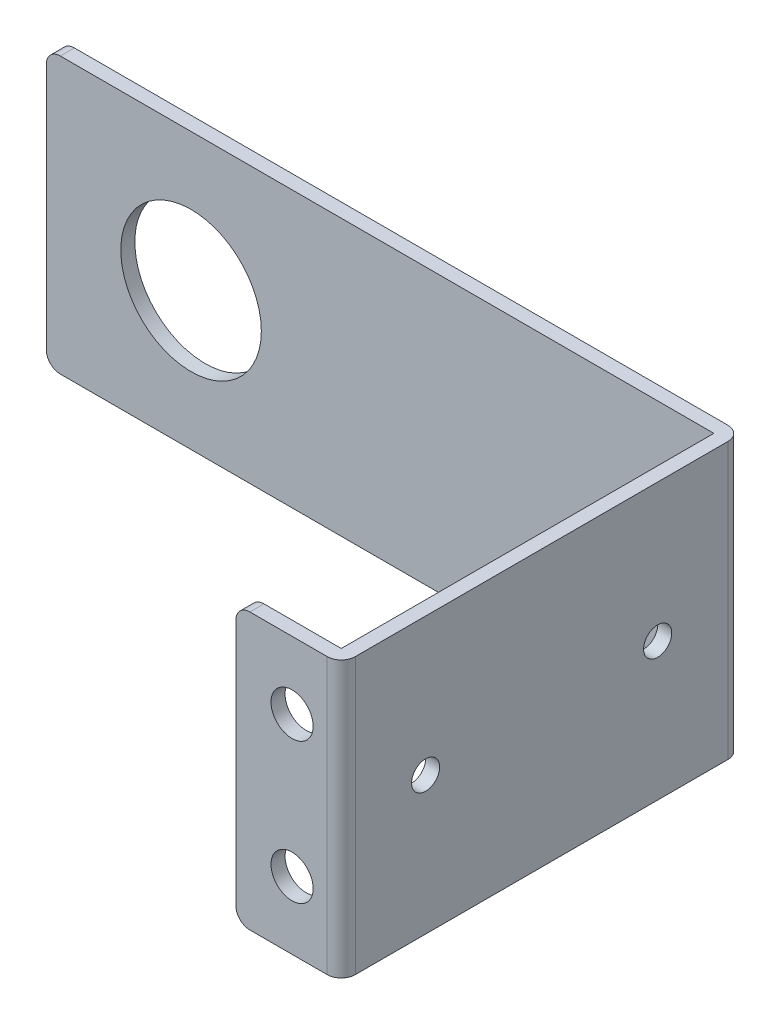
ISO-10303-21;
HEADER;
FILE_DESCRIPTION(('STEP AP214'),'2;1');
FILE_NAME('part.step','',(''),(''),'','','');
FILE_SCHEMA(('AUTOMOTIVE_DESIGN { 1 0 10303 214 1 1 1 1 }'));
ENDSEC;
DATA;
#1=APPLICATION_CONTEXT('core data for automotive mechanical design processes');
#2=APPLICATION_PROTOCOL_DEFINITION('international standard','automotive_design',2000,#1);
#3=PRODUCT_CONTEXT('',#1,'mechanical');
#4=PRODUCT('Part','Part','',(#3));
#5=PRODUCT_RELATED_PRODUCT_CATEGORY('part','',(#4));
#6=PRODUCT_DEFINITION_FORMATION('','',#4);
#7=PRODUCT_DEFINITION_CONTEXT('part definition',#1,'design');
#8=PRODUCT_DEFINITION('design','',#6,#7);
#9=PRODUCT_DEFINITION_SHAPE('','',#8);
#10=(LENGTH_UNIT() NAMED_UNIT(*) SI_UNIT(.MILLI.,.METRE.));
#11=(NAMED_UNIT(*) PLANE_ANGLE_UNIT() SI_UNIT($,.RADIAN.));
#12=(NAMED_UNIT(*) SI_UNIT($,.STERADIAN.) SOLID_ANGLE_UNIT());
#13=UNCERTAINTY_MEASURE_WITH_UNIT(LENGTH_MEASURE(1.E-05),#10,'distance_accuracy_value','');
#14=(GEOMETRIC_REPRESENTATION_CONTEXT(3) GLOBAL_UNCERTAINTY_ASSIGNED_CONTEXT((#13)) GLOBAL_UNIT_ASSIGNED_CONTEXT((#10,
#11,#12)) REPRESENTATION_CONTEXT('',''));
#15=CARTESIAN_POINT('',(0.,0.,0.));
#16=DIRECTION('',(0.,0.,1.));
#17=DIRECTION('',(1.,0.,0.));
#18=AXIS2_PLACEMENT_3D('',#15,#16,#17);
#19=CARTESIAN_POINT('',(23.75,9.8,28.512));
#20=DIRECTION('',(1.,0.,0.));
#21=DIRECTION('',(0.,0.,-1.));
#22=AXIS2_PLACEMENT_3D('',#19,#20,#21);
#23=PLANE('',#22);
#24=CARTESIAN_POINT('',(23.75,0.,22.512));
#25=DIRECTION('',(-1.,0.,0.));
#26=DIRECTION('',(0.,0.,1.));
#27=AXIS2_PLACEMENT_3D('',#24,#25,#26);
#28=CIRCLE('',#27,1.);
#29=CARTESIAN_POINT('',(23.75,0.,23.512));
#30=VERTEX_POINT('',#29);
#31=EDGE_CURVE('E270',#30,#30,#28,.T.);
#32=ORIENTED_EDGE('',*,*,#31,.F.);
#33=EDGE_LOOP('',(#32));
#34=FACE_BOUND('',#33,.T.);
#35=CARTESIAN_POINT('',(23.75,0.,6.));
#36=DIRECTION('',(-1.,0.,0.));
#37=DIRECTION('',(0.,0.,1.));
#38=AXIS2_PLACEMENT_3D('',#35,#36,#37);
#39=CIRCLE('',#38,1.);
#40=CARTESIAN_POINT('',(23.75,0.,7.));
#41=VERTEX_POINT('',#40);
#42=EDGE_CURVE('E269',#41,#41,#39,.T.);
#43=ORIENTED_EDGE('',*,*,#42,.F.);
#44=EDGE_LOOP('',(#43));
#45=FACE_BOUND('',#44,.T.);
#46=DIRECTION('',(0.,-1.,0.));
#47=VECTOR('',#46,1.);
#48=CARTESIAN_POINT('',(23.75,9.8,27.512));
#49=LINE('',#48,#47);
#50=CARTESIAN_POINT('',(23.75,9.8,27.512));
#51=VERTEX_POINT('',#50);
#52=CARTESIAN_POINT('',(23.75,-9.8,27.512));
#53=VERTEX_POINT('',#52);
#54=EDGE_CURVE('E138',#51,#53,#49,.T.);
#55=ORIENTED_EDGE('',*,*,#54,.F.);
#56=DIRECTION('',(0.,0.,-1.));
#57=VECTOR('',#56,1.);
#58=CARTESIAN_POINT('',(23.75,9.8,28.512));
#59=LINE('',#58,#57);
#60=CARTESIAN_POINT('',(23.75,9.8,1.));
#61=VERTEX_POINT('',#60);
#62=EDGE_CURVE('E147',#51,#61,#59,.T.);
#63=ORIENTED_EDGE('',*,*,#62,.T.);
#64=DIRECTION('',(0.,1.,0.));
#65=VECTOR('',#64,1.);
#66=CARTESIAN_POINT('',(23.75,-9.8,1.));
#67=LINE('',#66,#65);
#68=CARTESIAN_POINT('',(23.75,-9.8,1.));
#69=VERTEX_POINT('',#68);
#70=EDGE_CURVE('E192',#69,#61,#67,.T.);
#71=ORIENTED_EDGE('',*,*,#70,.F.);
#72=DIRECTION('',(0.,0.,-1.));
#73=VECTOR('',#72,1.);
#74=CARTESIAN_POINT('',(23.75,-9.8,28.512));
#75=LINE('',#74,#73);
#76=EDGE_CURVE('E150',#53,#69,#75,.T.);
#77=ORIENTED_EDGE('',*,*,#76,.F.);
#78=EDGE_LOOP('',(#55,#63,#71,#77));
#79=FACE_BOUND('',#78,.T.);
#80=ADVANCED_FACE('F32',(#34,#45,#79),#23,.F.);
#81=CARTESIAN_POINT('',(0.,0.,1.));
#82=DIRECTION('',(0.,0.,-1.));
#83=DIRECTION('',(-1.,0.,0.));
#84=AXIS2_PLACEMENT_3D('',#81,#82,#83);
#85=PLANE('',#84);
#86=DIRECTION('',(-1.,0.,0.));
#87=VECTOR('',#86,1.);
#88=CARTESIAN_POINT('',(-23.75,9.8,1.));
#89=LINE('',#88,#87);
#90=CARTESIAN_POINT('',(-22.75,9.8,1.));
#91=VERTEX_POINT('',#90);
#92=EDGE_CURVE('E157',#61,#91,#89,.T.);
#93=ORIENTED_EDGE('',*,*,#92,.T.);
#94=CARTESIAN_POINT('',(-22.75,8.8,1.));
#95=DIRECTION('',(0.,0.,-1.));
#96=DIRECTION('',(-1.,0.,0.));
#97=AXIS2_PLACEMENT_3D('',#94,#95,#96);
#98=CIRCLE('',#97,1.);
#99=CARTESIAN_POINT('',(-23.75,8.8,1.));
#100=VERTEX_POINT('',#99);
#101=EDGE_CURVE('E207',#91,#100,#98,.F.);
#102=ORIENTED_EDGE('',*,*,#101,.T.);
#103=DIRECTION('',(0.,-1.,0.));
#104=VECTOR('',#103,1.);
#105=CARTESIAN_POINT('',(-23.75,-9.8,1.));
#106=LINE('',#105,#104);
#107=CARTESIAN_POINT('',(-23.75,-8.80000000000001,1.));
#108=VERTEX_POINT('',#107);
#109=EDGE_CURVE('E189',#100,#108,#106,.T.);
#110=ORIENTED_EDGE('',*,*,#109,.T.);
#111=CARTESIAN_POINT('',(-22.75,-8.80000000000001,1.));
#112=DIRECTION('',(0.,0.,-1.));
#113=DIRECTION('',(-1.,0.,0.));
#114=AXIS2_PLACEMENT_3D('',#111,#112,#113);
#115=CIRCLE('',#114,1.);
#116=CARTESIAN_POINT('',(-22.75,-9.8,1.));
#117=VERTEX_POINT('',#116);
#118=EDGE_CURVE('E205',#108,#117,#115,.F.);
#119=ORIENTED_EDGE('',*,*,#118,.T.);
#120=DIRECTION('',(1.,0.,0.));
#121=VECTOR('',#120,1.);
#122=CARTESIAN_POINT('',(-23.75,-9.8,1.));
#123=LINE('',#122,#121);
#124=EDGE_CURVE('E199',#117,#69,#123,.T.);
#125=ORIENTED_EDGE('',*,*,#124,.T.);
#126=ORIENTED_EDGE('',*,*,#70,.T.);
#127=EDGE_LOOP('',(#93,#102,#110,#119,#125,#126));
#128=FACE_BOUND('',#127,.T.);
#129=CARTESIAN_POINT('',(-13.45,0.,1.));
#130=DIRECTION('',(0.,0.,1.));
#131=DIRECTION('',(1.,0.,0.));
#132=AXIS2_PLACEMENT_3D('',#129,#130,#131);
#133=CIRCLE('',#132,5.);
#134=CARTESIAN_POINT('',(-8.45,0.,1.));
#135=VERTEX_POINT('',#134);
#136=EDGE_CURVE('E180',#135,#135,#133,.T.);
#137=ORIENTED_EDGE('',*,*,#136,.F.);
#138=EDGE_LOOP('',(#137));
#139=FACE_BOUND('',#138,.T.);
#140=ADVANCED_FACE('F313',(#128,#139),#85,.F.);
#141=CARTESIAN_POINT('',(0.,0.,0.));
#142=DIRECTION('',(0.,0.,-1.));
#143=DIRECTION('',(-1.,0.,0.));
#144=AXIS2_PLACEMENT_3D('',#141,#142,#143);
#145=PLANE('',#144);
#146=DIRECTION('',(0.,-1.,0.));
#147=VECTOR('',#146,1.);
#148=CARTESIAN_POINT('',(-23.75,-9.8,0.));
#149=LINE('',#148,#147);
#150=CARTESIAN_POINT('',(-23.75,8.8,0.));
#151=VERTEX_POINT('',#150);
#152=CARTESIAN_POINT('',(-23.75,-8.80000000000001,0.));
#153=VERTEX_POINT('',#152);
#154=EDGE_CURVE('E362',#151,#153,#149,.T.);
#155=ORIENTED_EDGE('',*,*,#154,.F.);
#156=CARTESIAN_POINT('',(-22.75,8.8,0.));
#157=DIRECTION('',(0.,0.,-1.));
#158=DIRECTION('',(-1.,0.,0.));
#159=AXIS2_PLACEMENT_3D('',#156,#157,#158);
#160=CIRCLE('',#159,1.);
#161=CARTESIAN_POINT('',(-22.75,9.8,0.));
#162=VERTEX_POINT('',#161);
#163=EDGE_CURVE('E258',#151,#162,#160,.T.);
#164=ORIENTED_EDGE('',*,*,#163,.T.);
#165=DIRECTION('',(-1.,0.,0.));
#166=VECTOR('',#165,1.);
#167=CARTESIAN_POINT('',(-23.75,9.8,0.));
#168=LINE('',#167,#166);
#169=CARTESIAN_POINT('',(23.75,9.8,0.));
#170=VERTEX_POINT('',#169);
#171=EDGE_CURVE('E183',#170,#162,#168,.T.);
#172=ORIENTED_EDGE('',*,*,#171,.F.);
#173=DIRECTION('',(0.,1.,0.));
#174=VECTOR('',#173,1.);
#175=CARTESIAN_POINT('',(23.75,-9.8,0.));
#176=LINE('',#175,#174);
#177=CARTESIAN_POINT('',(23.75,-9.8,0.));
#178=VERTEX_POINT('',#177);
#179=EDGE_CURVE('E262',#170,#178,#176,.F.);
#180=ORIENTED_EDGE('',*,*,#179,.T.);
#181=DIRECTION('',(1.,0.,0.));
#182=VECTOR('',#181,1.);
#183=CARTESIAN_POINT('',(-23.75,-9.8,0.));
#184=LINE('',#183,#182);
#185=CARTESIAN_POINT('',(-22.75,-9.8,0.));
#186=VERTEX_POINT('',#185);
#187=EDGE_CURVE('E194',#186,#178,#184,.T.);
#188=ORIENTED_EDGE('',*,*,#187,.F.);
#189=CARTESIAN_POINT('',(-22.75,-8.80000000000001,0.));
#190=DIRECTION('',(0.,0.,-1.));
#191=DIRECTION('',(-1.,0.,0.));
#192=AXIS2_PLACEMENT_3D('',#189,#190,#191);
#193=CIRCLE('',#192,1.);
#194=EDGE_CURVE('E260',#186,#153,#193,.T.);
#195=ORIENTED_EDGE('',*,*,#194,.T.);
#196=EDGE_LOOP('',(#155,#164,#172,#180,#188,#195));
#197=FACE_BOUND('',#196,.T.);
#198=CARTESIAN_POINT('',(-13.45,0.,0.));
#199=DIRECTION('',(0.,0.,1.));
#200=DIRECTION('',(1.,0.,0.));
#201=AXIS2_PLACEMENT_3D('',#198,#199,#200);
#202=CIRCLE('',#201,5.);
#203=CARTESIAN_POINT('',(-8.45,0.,0.));
#204=VERTEX_POINT('',#203);
#205=EDGE_CURVE('E184',#204,#204,#202,.T.);
#206=ORIENTED_EDGE('',*,*,#205,.T.);
#207=EDGE_LOOP('',(#206));
#208=FACE_BOUND('',#207,.T.);
#209=ADVANCED_FACE('F319',(#197,#208),#145,.T.);
#210=CARTESIAN_POINT('',(-23.75,9.8,1.));
#211=DIRECTION('',(0.,-1.,0.));
#212=DIRECTION('',(0.,0.,-1.));
#213=AXIS2_PLACEMENT_3D('',#210,#211,#212);
#214=PLANE('',#213);
#215=ORIENTED_EDGE('',*,*,#171,.T.);
#216=DIRECTION('',(0.,0.,-1.));
#217=VECTOR('',#216,1.);
#218=CARTESIAN_POINT('',(-22.75,9.8,1.));
#219=LINE('',#218,#217);
#220=EDGE_CURVE('E203',#162,#91,#219,.F.);
#221=ORIENTED_EDGE('',*,*,#220,.T.);
#222=ORIENTED_EDGE('',*,*,#92,.F.);
#223=ORIENTED_EDGE('',*,*,#62,.F.);
#224=DIRECTION('',(1.,0.,0.));
#225=VECTOR('',#224,1.);
#226=CARTESIAN_POINT('',(17.25,9.8,27.512));
#227=LINE('',#226,#225);
#228=CARTESIAN_POINT('',(18.25,9.8,27.512));
#229=VERTEX_POINT('',#228);
#230=EDGE_CURVE('E135',#229,#51,#227,.T.);
#231=ORIENTED_EDGE('',*,*,#230,.F.);
#232=DIRECTION('',(0.,0.,-1.));
#233=VECTOR('',#232,1.);
#234=CARTESIAN_POINT('',(18.25,9.8,1.));
#235=LINE('',#234,#233);
#236=CARTESIAN_POINT('',(18.25,9.8,28.512));
#237=VERTEX_POINT('',#236);
#238=EDGE_CURVE('E253',#229,#237,#235,.F.);
#239=ORIENTED_EDGE('',*,*,#238,.T.);
#240=DIRECTION('',(-1.,0.,0.));
#241=VECTOR('',#240,1.);
#242=CARTESIAN_POINT('',(23.75,9.8,28.512));
#243=LINE('',#242,#241);
#244=CARTESIAN_POINT('',(23.75,9.8,28.512));
#245=VERTEX_POINT('',#244);
#246=EDGE_CURVE('E160',#245,#237,#243,.T.);
#247=ORIENTED_EDGE('',*,*,#246,.F.);
#248=CARTESIAN_POINT('',(23.75,9.8,27.512));
#249=DIRECTION('',(0.,-1.,0.));
#250=DIRECTION('',(0.,0.,-1.));
#251=AXIS2_PLACEMENT_3D('',#248,#249,#250);
#252=CIRCLE('',#251,1.);
#253=CARTESIAN_POINT('',(24.75,9.8,27.512));
#254=VERTEX_POINT('',#253);
#255=EDGE_CURVE('E247',#245,#254,#252,.F.);
#256=ORIENTED_EDGE('',*,*,#255,.T.);
#257=DIRECTION('',(0.,0.,-1.));
#258=VECTOR('',#257,1.);
#259=CARTESIAN_POINT('',(24.75,9.8,28.512));
#260=LINE('',#259,#258);
#261=CARTESIAN_POINT('',(24.75,9.8,1.));
#262=VERTEX_POINT('',#261);
#263=EDGE_CURVE('E159',#254,#262,#260,.T.);
#264=ORIENTED_EDGE('',*,*,#263,.T.);
#265=CARTESIAN_POINT('',(23.75,9.8,1.));
#266=DIRECTION('',(0.,-1.,0.));
#267=DIRECTION('',(0.,0.,-1.));
#268=AXIS2_PLACEMENT_3D('',#265,#266,#267);
#269=CIRCLE('',#268,1.);
#270=EDGE_CURVE('E254',#262,#170,#269,.F.);
#271=ORIENTED_EDGE('',*,*,#270,.T.);
#272=EDGE_LOOP('',(#215,#221,#222,#223,#231,#239,#247,#256,#264,#271));
#273=FACE_BOUND('',#272,.T.);
#274=ADVANCED_FACE('F155',(#273),#214,.F.);
#275=CARTESIAN_POINT('',(-23.75,-9.8,1.));
#276=DIRECTION('',(1.,0.,0.));
#277=DIRECTION('',(0.,0.,-1.));
#278=AXIS2_PLACEMENT_3D('',#275,#276,#277);
#279=PLANE('',#278);
#280=ORIENTED_EDGE('',*,*,#109,.F.);
#281=DIRECTION('',(0.,0.,-1.));
#282=VECTOR('',#281,1.);
#283=CARTESIAN_POINT('',(-23.75,8.8,1.));
#284=LINE('',#283,#282);
#285=EDGE_CURVE('E264',#100,#151,#284,.T.);
#286=ORIENTED_EDGE('',*,*,#285,.T.);
#287=ORIENTED_EDGE('',*,*,#154,.T.);
#288=DIRECTION('',(0.,0.,-1.));
#289=VECTOR('',#288,1.);
#290=CARTESIAN_POINT('',(-23.75,-8.80000000000001,1.));
#291=LINE('',#290,#289);
#292=EDGE_CURVE('E202',#153,#108,#291,.F.);
#293=ORIENTED_EDGE('',*,*,#292,.T.);
#294=EDGE_LOOP('',(#280,#286,#287,#293));
#295=FACE_BOUND('',#294,.T.);
#296=ADVANCED_FACE('F335',(#295),#279,.F.);
#297=CARTESIAN_POINT('',(-23.75,-9.8,1.));
#298=DIRECTION('',(0.,1.,0.));
#299=DIRECTION('',(0.,0.,1.));
#300=AXIS2_PLACEMENT_3D('',#297,#298,#299);
#301=PLANE('',#300);
#302=ORIENTED_EDGE('',*,*,#124,.F.);
#303=DIRECTION('',(0.,0.,-1.));
#304=VECTOR('',#303,1.);
#305=CARTESIAN_POINT('',(-22.75,-9.8,1.));
#306=LINE('',#305,#304);
#307=EDGE_CURVE('E215',#117,#186,#306,.T.);
#308=ORIENTED_EDGE('',*,*,#307,.T.);
#309=ORIENTED_EDGE('',*,*,#187,.T.);
#310=CARTESIAN_POINT('',(23.75,-9.8,1.));
#311=DIRECTION('',(0.,1.,0.));
#312=DIRECTION('',(0.,0.,1.));
#313=AXIS2_PLACEMENT_3D('',#310,#311,#312);
#314=CIRCLE('',#313,1.);
#315=CARTESIAN_POINT('',(24.75,-9.8,1.));
#316=VERTEX_POINT('',#315);
#317=EDGE_CURVE('E211',#178,#316,#314,.F.);
#318=ORIENTED_EDGE('',*,*,#317,.T.);
#319=DIRECTION('',(0.,0.,-1.));
#320=VECTOR('',#319,1.);
#321=CARTESIAN_POINT('',(24.75,-9.8,28.512));
#322=LINE('',#321,#320);
#323=CARTESIAN_POINT('',(24.75,-9.8,27.512));
#324=VERTEX_POINT('',#323);
#325=EDGE_CURVE('E163',#324,#316,#322,.T.);
#326=ORIENTED_EDGE('',*,*,#325,.F.);
#327=CARTESIAN_POINT('',(23.75,-9.8,27.512));
#328=DIRECTION('',(0.,1.,0.));
#329=DIRECTION('',(0.,0.,1.));
#330=AXIS2_PLACEMENT_3D('',#327,#328,#329);
#331=CIRCLE('',#330,1.);
#332=CARTESIAN_POINT('',(23.75,-9.8,28.512));
#333=VERTEX_POINT('',#332);
#334=EDGE_CURVE('E209',#324,#333,#331,.F.);
#335=ORIENTED_EDGE('',*,*,#334,.T.);
#336=DIRECTION('',(1.,0.,0.));
#337=VECTOR('',#336,1.);
#338=CARTESIAN_POINT('',(23.75,-9.8,28.512));
#339=LINE('',#338,#337);
#340=CARTESIAN_POINT('',(18.25,-9.8,28.512));
#341=VERTEX_POINT('',#340);
#342=EDGE_CURVE('E142',#341,#333,#339,.T.);
#343=ORIENTED_EDGE('',*,*,#342,.F.);
#344=DIRECTION('',(0.,0.,1.));
#345=VECTOR('',#344,1.);
#346=CARTESIAN_POINT('',(18.25,-9.8,1.));
#347=LINE('',#346,#345);
#348=CARTESIAN_POINT('',(18.25,-9.8,27.512));
#349=VERTEX_POINT('',#348);
#350=EDGE_CURVE('E213',#341,#349,#347,.F.);
#351=ORIENTED_EDGE('',*,*,#350,.T.);
#352=DIRECTION('',(1.,0.,0.));
#353=VECTOR('',#352,1.);
#354=CARTESIAN_POINT('',(17.25,-9.8,27.512));
#355=LINE('',#354,#353);
#356=EDGE_CURVE('E143',#349,#53,#355,.T.);
#357=ORIENTED_EDGE('',*,*,#356,.T.);
#358=ORIENTED_EDGE('',*,*,#76,.T.);
#359=EDGE_LOOP('',(#302,#308,#309,#318,#326,#335,#343,#351,#357,#358));
#360=FACE_BOUND('',#359,.T.);
#361=ADVANCED_FACE('F241',(#360),#301,.F.);
#362=CARTESIAN_POINT('',(-13.45,0.,1.));
#363=DIRECTION('',(0.,0.,-1.));
#364=DIRECTION('',(-1.,0.,0.));
#365=AXIS2_PLACEMENT_3D('',#362,#363,#364);
#366=CYLINDRICAL_SURFACE('',#365,5.);
#367=ORIENTED_EDGE('',*,*,#136,.T.);
#368=EDGE_LOOP('',(#367));
#369=FACE_BOUND('',#368,.T.);
#370=ORIENTED_EDGE('',*,*,#205,.F.);
#371=EDGE_LOOP('',(#370));
#372=FACE_BOUND('',#371,.T.);
#373=ADVANCED_FACE('F326',(#369,#372),#366,.F.);
#374=CARTESIAN_POINT('',(24.75,9.8,28.512));
#375=DIRECTION('',(-1.,0.,0.));
#376=DIRECTION('',(0.,-1.,0.));
#377=AXIS2_PLACEMENT_3D('',#374,#375,#376);
#378=PLANE('',#377);
#379=CARTESIAN_POINT('',(24.75,0.,22.512));
#380=DIRECTION('',(-1.,0.,0.));
#381=DIRECTION('',(0.,-1.,0.));
#382=AXIS2_PLACEMENT_3D('',#379,#380,#381);
#383=CIRCLE('',#382,1.);
#384=CARTESIAN_POINT('',(24.75,-1.,22.512));
#385=VERTEX_POINT('',#384);
#386=EDGE_CURVE('E267',#385,#385,#383,.T.);
#387=ORIENTED_EDGE('',*,*,#386,.T.);
#388=EDGE_LOOP('',(#387));
#389=FACE_BOUND('',#388,.T.);
#390=CARTESIAN_POINT('',(24.75,0.,6.));
#391=DIRECTION('',(-1.,0.,0.));
#392=DIRECTION('',(0.,-1.,0.));
#393=AXIS2_PLACEMENT_3D('',#390,#391,#392);
#394=CIRCLE('',#393,1.);
#395=CARTESIAN_POINT('',(24.75,-1.,6.));
#396=VERTEX_POINT('',#395);
#397=EDGE_CURVE('E172',#396,#396,#394,.T.);
#398=ORIENTED_EDGE('',*,*,#397,.T.);
#399=EDGE_LOOP('',(#398));
#400=FACE_BOUND('',#399,.T.);
#401=ORIENTED_EDGE('',*,*,#325,.T.);
#402=DIRECTION('',(0.,1.,0.));
#403=VECTOR('',#402,1.);
#404=CARTESIAN_POINT('',(24.75,9.8,1.));
#405=LINE('',#404,#403);
#406=EDGE_CURVE('E11',#316,#262,#405,.T.);
#407=ORIENTED_EDGE('',*,*,#406,.T.);
#408=ORIENTED_EDGE('',*,*,#263,.F.);
#409=DIRECTION('',(0.,1.,0.));
#410=VECTOR('',#409,1.);
#411=CARTESIAN_POINT('',(24.75,-9.8,27.512));
#412=LINE('',#411,#410);
#413=EDGE_CURVE('E40',#254,#324,#412,.F.);
#414=ORIENTED_EDGE('',*,*,#413,.T.);
#415=EDGE_LOOP('',(#401,#407,#408,#414));
#416=FACE_BOUND('',#415,.T.);
#417=ADVANCED_FACE('F235',(#389,#400,#416),#378,.F.);
#418=CARTESIAN_POINT('',(0.,0.,28.512));
#419=DIRECTION('',(0.,0.,1.));
#420=DIRECTION('',(1.,0.,0.));
#421=AXIS2_PLACEMENT_3D('',#418,#419,#420);
#422=PLANE('',#421);
#423=CARTESIAN_POINT('',(21.25,-5.,28.512));
#424=DIRECTION('',(0.,0.,1.));
#425=DIRECTION('',(1.,0.,0.));
#426=AXIS2_PLACEMENT_3D('',#423,#424,#425);
#427=CIRCLE('',#426,1.5);
#428=CARTESIAN_POINT('',(22.75,-5.,28.512));
#429=VERTEX_POINT('',#428);
#430=EDGE_CURVE('E280',#429,#429,#427,.T.);
#431=ORIENTED_EDGE('',*,*,#430,.F.);
#432=EDGE_LOOP('',(#431));
#433=FACE_BOUND('',#432,.T.);
#434=CARTESIAN_POINT('',(21.25,5.,28.512));
#435=DIRECTION('',(0.,0.,1.));
#436=DIRECTION('',(1.,0.,0.));
#437=AXIS2_PLACEMENT_3D('',#434,#435,#436);
#438=CIRCLE('',#437,1.5);
#439=CARTESIAN_POINT('',(22.75,5.,28.512));
#440=VERTEX_POINT('',#439);
#441=EDGE_CURVE('E286',#440,#440,#438,.T.);
#442=ORIENTED_EDGE('',*,*,#441,.F.);
#443=EDGE_LOOP('',(#442));
#444=FACE_BOUND('',#443,.T.);
#445=DIRECTION('',(0.,1.,0.));
#446=VECTOR('',#445,1.);
#447=CARTESIAN_POINT('',(17.25,9.8,28.512));
#448=LINE('',#447,#446);
#449=CARTESIAN_POINT('',(17.25,-8.80000000000001,28.512));
#450=VERTEX_POINT('',#449);
#451=CARTESIAN_POINT('',(17.25,8.8,28.512));
#452=VERTEX_POINT('',#451);
#453=EDGE_CURVE('E151',#450,#452,#448,.T.);
#454=ORIENTED_EDGE('',*,*,#453,.F.);
#455=CARTESIAN_POINT('',(18.25,-8.80000000000001,28.512));
#456=DIRECTION('',(0.,0.,1.));
#457=DIRECTION('',(1.,0.,0.));
#458=AXIS2_PLACEMENT_3D('',#455,#456,#457);
#459=CIRCLE('',#458,1.);
#460=EDGE_CURVE('E228',#450,#341,#459,.T.);
#461=ORIENTED_EDGE('',*,*,#460,.T.);
#462=ORIENTED_EDGE('',*,*,#342,.T.);
#463=DIRECTION('',(0.,1.,0.));
#464=VECTOR('',#463,1.);
#465=CARTESIAN_POINT('',(23.75,9.8,28.512));
#466=LINE('',#465,#464);
#467=EDGE_CURVE('E223',#333,#245,#466,.T.);
#468=ORIENTED_EDGE('',*,*,#467,.T.);
#469=ORIENTED_EDGE('',*,*,#246,.T.);
#470=CARTESIAN_POINT('',(18.25,8.8,28.512));
#471=DIRECTION('',(0.,0.,1.));
#472=DIRECTION('',(1.,0.,0.));
#473=AXIS2_PLACEMENT_3D('',#470,#471,#472);
#474=CIRCLE('',#473,1.);
#475=EDGE_CURVE('E226',#237,#452,#474,.T.);
#476=ORIENTED_EDGE('',*,*,#475,.T.);
#477=EDGE_LOOP('',(#454,#461,#462,#468,#469,#476));
#478=FACE_BOUND('',#477,.T.);
#479=ADVANCED_FACE('F251',(#433,#444,#478),#422,.T.);
#480=CARTESIAN_POINT('',(17.25,9.8,27.512));
#481=DIRECTION('',(0.,0.,1.));
#482=DIRECTION('',(1.,0.,0.));
#483=AXIS2_PLACEMENT_3D('',#480,#481,#482);
#484=PLANE('',#483);
#485=CARTESIAN_POINT('',(21.25,-5.,27.512));
#486=DIRECTION('',(0.,0.,1.));
#487=DIRECTION('',(1.,0.,0.));
#488=AXIS2_PLACEMENT_3D('',#485,#486,#487);
#489=CIRCLE('',#488,1.5);
#490=CARTESIAN_POINT('',(22.75,-5.,27.512));
#491=VERTEX_POINT('',#490);
#492=EDGE_CURVE('E283',#491,#491,#489,.F.);
#493=ORIENTED_EDGE('',*,*,#492,.F.);
#494=EDGE_LOOP('',(#493));
#495=FACE_BOUND('',#494,.T.);
#496=CARTESIAN_POINT('',(21.25,5.,27.512));
#497=DIRECTION('',(0.,0.,1.));
#498=DIRECTION('',(1.,0.,0.));
#499=AXIS2_PLACEMENT_3D('',#496,#497,#498);
#500=CIRCLE('',#499,1.5);
#501=CARTESIAN_POINT('',(22.75,5.,27.512));
#502=VERTEX_POINT('',#501);
#503=EDGE_CURVE('E152',#502,#502,#500,.F.);
#504=ORIENTED_EDGE('',*,*,#503,.F.);
#505=EDGE_LOOP('',(#504));
#506=FACE_BOUND('',#505,.T.);
#507=ORIENTED_EDGE('',*,*,#356,.F.);
#508=CARTESIAN_POINT('',(18.25,-8.80000000000001,27.512));
#509=DIRECTION('',(0.,0.,1.));
#510=DIRECTION('',(1.,0.,0.));
#511=AXIS2_PLACEMENT_3D('',#508,#509,#510);
#512=CIRCLE('',#511,1.);
#513=CARTESIAN_POINT('',(17.25,-8.80000000000001,27.512));
#514=VERTEX_POINT('',#513);
#515=EDGE_CURVE('E47',#349,#514,#512,.F.);
#516=ORIENTED_EDGE('',*,*,#515,.T.);
#517=DIRECTION('',(0.,-1.,0.));
#518=VECTOR('',#517,1.);
#519=CARTESIAN_POINT('',(17.25,9.8,27.512));
#520=LINE('',#519,#518);
#521=CARTESIAN_POINT('',(17.25,8.8,27.512));
#522=VERTEX_POINT('',#521);
#523=EDGE_CURVE('E293',#522,#514,#520,.T.);
#524=ORIENTED_EDGE('',*,*,#523,.F.);
#525=CARTESIAN_POINT('',(18.25,8.8,27.512));
#526=DIRECTION('',(0.,0.,1.));
#527=DIRECTION('',(1.,0.,0.));
#528=AXIS2_PLACEMENT_3D('',#525,#526,#527);
#529=CIRCLE('',#528,1.);
#530=EDGE_CURVE('E55',#522,#229,#529,.F.);
#531=ORIENTED_EDGE('',*,*,#530,.T.);
#532=ORIENTED_EDGE('',*,*,#230,.T.);
#533=ORIENTED_EDGE('',*,*,#54,.T.);
#534=EDGE_LOOP('',(#507,#516,#524,#531,#532,#533));
#535=FACE_BOUND('',#534,.T.);
#536=ADVANCED_FACE('F137',(#495,#506,#535),#484,.F.);
#537=CARTESIAN_POINT('',(17.25,0.,0.));
#538=DIRECTION('',(1.,0.,0.));
#539=DIRECTION('',(0.,0.,-1.));
#540=AXIS2_PLACEMENT_3D('',#537,#538,#539);
#541=PLANE('',#540);
#542=ORIENTED_EDGE('',*,*,#523,.T.);
#543=DIRECTION('',(0.,0.,1.));
#544=VECTOR('',#543,1.);
#545=CARTESIAN_POINT('',(17.25,-8.80000000000001,0.));
#546=LINE('',#545,#544);
#547=EDGE_CURVE('E220',#514,#450,#546,.T.);
#548=ORIENTED_EDGE('',*,*,#547,.T.);
#549=ORIENTED_EDGE('',*,*,#453,.T.);
#550=DIRECTION('',(0.,0.,-1.));
#551=VECTOR('',#550,1.);
#552=CARTESIAN_POINT('',(17.25,8.8,0.));
#553=LINE('',#552,#551);
#554=EDGE_CURVE('E218',#452,#522,#553,.T.);
#555=ORIENTED_EDGE('',*,*,#554,.T.);
#556=EDGE_LOOP('',(#542,#548,#549,#555));
#557=FACE_BOUND('',#556,.T.);
#558=ADVANCED_FACE('F300',(#557),#541,.F.);
#559=CARTESIAN_POINT('',(21.25,5.,-0.001000000000001));
#560=DIRECTION('',(0.,0.,1.));
#561=DIRECTION('',(1.,0.,0.));
#562=AXIS2_PLACEMENT_3D('',#559,#560,#561);
#563=CYLINDRICAL_SURFACE('',#562,1.5);
#564=ORIENTED_EDGE('',*,*,#441,.T.);
#565=EDGE_LOOP('',(#564));
#566=FACE_BOUND('',#565,.T.);
#567=ORIENTED_EDGE('',*,*,#503,.T.);
#568=EDGE_LOOP('',(#567));
#569=FACE_BOUND('',#568,.T.);
#570=ADVANCED_FACE('F429',(#566,#569),#563,.F.);
#571=CARTESIAN_POINT('',(21.25,-5.,-0.001000000000001));
#572=DIRECTION('',(0.,0.,1.));
#573=DIRECTION('',(1.,0.,0.));
#574=AXIS2_PLACEMENT_3D('',#571,#572,#573);
#575=CYLINDRICAL_SURFACE('',#574,1.5);
#576=ORIENTED_EDGE('',*,*,#430,.T.);
#577=EDGE_LOOP('',(#576));
#578=FACE_BOUND('',#577,.T.);
#579=ORIENTED_EDGE('',*,*,#492,.T.);
#580=EDGE_LOOP('',(#579));
#581=FACE_BOUND('',#580,.T.);
#582=ADVANCED_FACE('F420',(#578,#581),#575,.F.);
#583=CARTESIAN_POINT('',(30.25,0.,6.));
#584=DIRECTION('',(-1.,0.,0.));
#585=DIRECTION('',(0.,0.,1.));
#586=AXIS2_PLACEMENT_3D('',#583,#584,#585);
#587=CYLINDRICAL_SURFACE('',#586,1.);
#588=ORIENTED_EDGE('',*,*,#42,.T.);
#589=EDGE_LOOP('',(#588));
#590=FACE_BOUND('',#589,.T.);
#591=ORIENTED_EDGE('',*,*,#397,.F.);
#592=EDGE_LOOP('',(#591));
#593=FACE_BOUND('',#592,.T.);
#594=ADVANCED_FACE('F411',(#590,#593),#587,.F.);
#595=CARTESIAN_POINT('',(30.25,0.,22.512));
#596=DIRECTION('',(-1.,0.,0.));
#597=DIRECTION('',(0.,0.,1.));
#598=AXIS2_PLACEMENT_3D('',#595,#596,#597);
#599=CYLINDRICAL_SURFACE('',#598,1.);
#600=ORIENTED_EDGE('',*,*,#31,.T.);
#601=EDGE_LOOP('',(#600));
#602=FACE_BOUND('',#601,.T.);
#603=ORIENTED_EDGE('',*,*,#386,.F.);
#604=EDGE_LOOP('',(#603));
#605=FACE_BOUND('',#604,.T.);
#606=ADVANCED_FACE('F344',(#602,#605),#599,.F.);
#607=CARTESIAN_POINT('',(-22.75,8.8,1.));
#608=DIRECTION('',(0.,0.,-1.));
#609=DIRECTION('',(-1.,0.,0.));
#610=AXIS2_PLACEMENT_3D('',#607,#608,#609);
#611=CYLINDRICAL_SURFACE('',#610,1.);
#612=ORIENTED_EDGE('',*,*,#101,.F.);
#613=ORIENTED_EDGE('',*,*,#220,.F.);
#614=ORIENTED_EDGE('',*,*,#163,.F.);
#615=ORIENTED_EDGE('',*,*,#285,.F.);
#616=EDGE_LOOP('',(#612,#613,#614,#615));
#617=FACE_BOUND('',#616,.T.);
#618=ADVANCED_FACE('F341',(#617),#611,.T.);
#619=CARTESIAN_POINT('',(-22.75,-8.80000000000001,1.));
#620=DIRECTION('',(0.,0.,-1.));
#621=DIRECTION('',(-1.,0.,0.));
#622=AXIS2_PLACEMENT_3D('',#619,#620,#621);
#623=CYLINDRICAL_SURFACE('',#622,1.);
#624=ORIENTED_EDGE('',*,*,#118,.F.);
#625=ORIENTED_EDGE('',*,*,#292,.F.);
#626=ORIENTED_EDGE('',*,*,#194,.F.);
#627=ORIENTED_EDGE('',*,*,#307,.F.);
#628=EDGE_LOOP('',(#624,#625,#626,#627));
#629=FACE_BOUND('',#628,.T.);
#630=ADVANCED_FACE('F310',(#629),#623,.T.);
#631=CARTESIAN_POINT('',(18.25,-8.80000000000001,0.));
#632=DIRECTION('',(0.,0.,1.));
#633=DIRECTION('',(1.,0.,0.));
#634=AXIS2_PLACEMENT_3D('',#631,#632,#633);
#635=CYLINDRICAL_SURFACE('',#634,1.);
#636=ORIENTED_EDGE('',*,*,#515,.F.);
#637=ORIENTED_EDGE('',*,*,#350,.F.);
#638=ORIENTED_EDGE('',*,*,#460,.F.);
#639=ORIENTED_EDGE('',*,*,#547,.F.);
#640=EDGE_LOOP('',(#636,#637,#638,#639));
#641=FACE_BOUND('',#640,.T.);
#642=ADVANCED_FACE('F298',(#641),#635,.T.);
#643=CARTESIAN_POINT('',(18.25,8.8,0.));
#644=DIRECTION('',(0.,0.,-1.));
#645=DIRECTION('',(-1.,0.,0.));
#646=AXIS2_PLACEMENT_3D('',#643,#644,#645);
#647=CYLINDRICAL_SURFACE('',#646,1.);
#648=ORIENTED_EDGE('',*,*,#475,.F.);
#649=ORIENTED_EDGE('',*,*,#238,.F.);
#650=ORIENTED_EDGE('',*,*,#530,.F.);
#651=ORIENTED_EDGE('',*,*,#554,.F.);
#652=EDGE_LOOP('',(#648,#649,#650,#651));
#653=FACE_BOUND('',#652,.T.);
#654=ADVANCED_FACE('F301',(#653),#647,.T.);
#655=CARTESIAN_POINT('',(23.75,9.8,1.));
#656=DIRECTION('',(0.,-1.,0.));
#657=DIRECTION('',(1.,0.,0.));
#658=AXIS2_PLACEMENT_3D('',#655,#656,#657);
#659=CYLINDRICAL_SURFACE('',#658,1.);
#660=ORIENTED_EDGE('',*,*,#317,.F.);
#661=ORIENTED_EDGE('',*,*,#179,.F.);
#662=ORIENTED_EDGE('',*,*,#270,.F.);
#663=ORIENTED_EDGE('',*,*,#406,.F.);
#664=EDGE_LOOP('',(#660,#661,#662,#663));
#665=FACE_BOUND('',#664,.T.);
#666=ADVANCED_FACE('F303',(#665),#659,.T.);
#667=CARTESIAN_POINT('',(23.75,0.,27.512));
#668=DIRECTION('',(0.,-1.,0.));
#669=DIRECTION('',(1.,0.,0.));
#670=AXIS2_PLACEMENT_3D('',#667,#668,#669);
#671=CYLINDRICAL_SURFACE('',#670,1.);
#672=ORIENTED_EDGE('',*,*,#334,.F.);
#673=ORIENTED_EDGE('',*,*,#413,.F.);
#674=ORIENTED_EDGE('',*,*,#255,.F.);
#675=ORIENTED_EDGE('',*,*,#467,.F.);
#676=EDGE_LOOP('',(#672,#673,#674,#675));
#677=FACE_BOUND('',#676,.T.);
#678=ADVANCED_FACE('F34',(#677),#671,.T.);
#679=CLOSED_SHELL('',(#80,#140,#209,#274,#296,#361,#373,#417,#479,#536,#558,#570,#582,#594,#606,
#618,#630,#642,#654,#666,#678));
#680=MANIFOLD_SOLID_BREP('B2',#679);
#681=ADVANCED_BREP_SHAPE_REPRESENTATION('',(#18,#680),#14);
#682=SHAPE_DEFINITION_REPRESENTATION(#9,#681);
ENDSEC;
END-ISO-10303-21;
